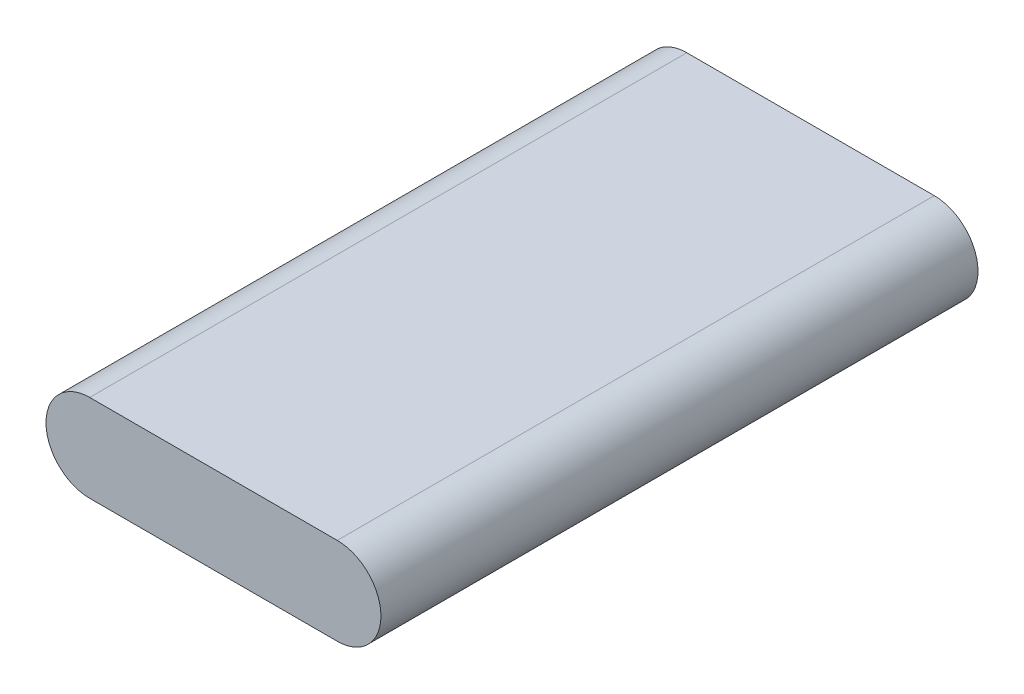
ISO-10303-21;
HEADER;
FILE_DESCRIPTION(('STEP AP214'),'2;1');
FILE_NAME('part.step','',(''),(''),'','','');
FILE_SCHEMA(('AUTOMOTIVE_DESIGN { 1 0 10303 214 1 1 1 1 }'));
ENDSEC;
DATA;
#1=APPLICATION_CONTEXT('core data for automotive mechanical design processes');
#2=APPLICATION_PROTOCOL_DEFINITION('international standard','automotive_design',2000,#1);
#3=PRODUCT_CONTEXT('',#1,'mechanical');
#4=PRODUCT('Part','Part','',(#3));
#5=PRODUCT_RELATED_PRODUCT_CATEGORY('part','',(#4));
#6=PRODUCT_DEFINITION_FORMATION('','',#4);
#7=PRODUCT_DEFINITION_CONTEXT('part definition',#1,'design');
#8=PRODUCT_DEFINITION('design','',#6,#7);
#9=PRODUCT_DEFINITION_SHAPE('','',#8);
#10=(LENGTH_UNIT() NAMED_UNIT(*) SI_UNIT(.MILLI.,.METRE.));
#11=(NAMED_UNIT(*) PLANE_ANGLE_UNIT() SI_UNIT($,.RADIAN.));
#12=(NAMED_UNIT(*) SI_UNIT($,.STERADIAN.) SOLID_ANGLE_UNIT());
#13=UNCERTAINTY_MEASURE_WITH_UNIT(LENGTH_MEASURE(1.E-05),#10,'distance_accuracy_value','');
#14=(GEOMETRIC_REPRESENTATION_CONTEXT(3) GLOBAL_UNCERTAINTY_ASSIGNED_CONTEXT((#13)) GLOBAL_UNIT_ASSIGNED_CONTEXT((#10,
#11,#12)) REPRESENTATION_CONTEXT('',''));
#15=CARTESIAN_POINT('',(0.,0.,0.));
#16=DIRECTION('',(0.,0.,1.));
#17=DIRECTION('',(1.,0.,0.));
#18=AXIS2_PLACEMENT_3D('',#15,#16,#17);
#19=CARTESIAN_POINT('',(0.,7.62,104.14));
#20=DIRECTION('',(0.,0.,-1.));
#21=DIRECTION('',(-1.,0.,0.));
#22=AXIS2_PLACEMENT_3D('',#19,#20,#21);
#23=CYLINDRICAL_SURFACE('',#22,7.62);
#24=CARTESIAN_POINT('',(0.,7.62,0.));
#25=DIRECTION('',(0.,0.,1.));
#26=DIRECTION('',(1.,0.,0.));
#27=AXIS2_PLACEMENT_3D('',#24,#25,#26);
#28=CIRCLE('',#27,7.62);
#29=CARTESIAN_POINT('',(0.,15.24,0.));
#30=VERTEX_POINT('',#29);
#31=CARTESIAN_POINT('',(0.,0.,0.));
#32=VERTEX_POINT('',#31);
#33=EDGE_CURVE('E95',#30,#32,#28,.T.);
#34=ORIENTED_EDGE('',*,*,#33,.T.);
#35=DIRECTION('',(0.,0.,-1.));
#36=VECTOR('',#35,1.);
#37=CARTESIAN_POINT('',(0.,0.,104.14));
#38=LINE('',#37,#36);
#39=CARTESIAN_POINT('',(0.,0.,104.14));
#40=VERTEX_POINT('',#39);
#41=EDGE_CURVE('E11',#40,#32,#38,.T.);
#42=ORIENTED_EDGE('',*,*,#41,.F.);
#43=CARTESIAN_POINT('',(0.,7.62,104.14));
#44=DIRECTION('',(0.,0.,1.));
#45=DIRECTION('',(1.,0.,0.));
#46=AXIS2_PLACEMENT_3D('',#43,#44,#45);
#47=CIRCLE('',#46,7.62);
#48=CARTESIAN_POINT('',(0.,15.24,104.14));
#49=VERTEX_POINT('',#48);
#50=EDGE_CURVE('E83',#49,#40,#47,.T.);
#51=ORIENTED_EDGE('',*,*,#50,.F.);
#52=DIRECTION('',(0.,0.,-1.));
#53=VECTOR('',#52,1.);
#54=CARTESIAN_POINT('',(0.,15.24,104.14));
#55=LINE('',#54,#53);
#56=EDGE_CURVE('E91',#49,#30,#55,.T.);
#57=ORIENTED_EDGE('',*,*,#56,.T.);
#58=EDGE_LOOP('',(#34,#42,#51,#57));
#59=FACE_BOUND('',#58,.T.);
#60=ADVANCED_FACE('F32',(#59),#23,.T.);
#61=CARTESIAN_POINT('',(0.,0.,104.14));
#62=DIRECTION('',(0.,1.,0.));
#63=DIRECTION('',(-1.,0.,0.));
#64=AXIS2_PLACEMENT_3D('',#61,#62,#63);
#65=PLANE('',#64);
#66=DIRECTION('',(1.,0.,0.));
#67=VECTOR('',#66,1.);
#68=CARTESIAN_POINT('',(0.,0.,0.));
#69=LINE('',#68,#67);
#70=CARTESIAN_POINT('',(43.18,0.,0.));
#71=VERTEX_POINT('',#70);
#72=EDGE_CURVE('E87',#32,#71,#69,.T.);
#73=ORIENTED_EDGE('',*,*,#72,.T.);
#74=DIRECTION('',(0.,0.,-1.));
#75=VECTOR('',#74,1.);
#76=CARTESIAN_POINT('',(43.18,0.,104.14));
#77=LINE('',#76,#75);
#78=CARTESIAN_POINT('',(43.18,0.,104.14));
#79=VERTEX_POINT('',#78);
#80=EDGE_CURVE('E40',#79,#71,#77,.T.);
#81=ORIENTED_EDGE('',*,*,#80,.F.);
#82=DIRECTION('',(1.,0.,0.));
#83=VECTOR('',#82,1.);
#84=CARTESIAN_POINT('',(0.,0.,104.14));
#85=LINE('',#84,#83);
#86=EDGE_CURVE('E78',#40,#79,#85,.T.);
#87=ORIENTED_EDGE('',*,*,#86,.F.);
#88=ORIENTED_EDGE('',*,*,#41,.T.);
#89=EDGE_LOOP('',(#73,#81,#87,#88));
#90=FACE_BOUND('',#89,.T.);
#91=ADVANCED_FACE('F86',(#90),#65,.F.);
#92=CARTESIAN_POINT('',(43.18,7.61999999999999,104.14));
#93=DIRECTION('',(0.,0.,-1.));
#94=DIRECTION('',(-1.,0.,0.));
#95=AXIS2_PLACEMENT_3D('',#92,#93,#94);
#96=CYLINDRICAL_SURFACE('',#95,7.62);
#97=CARTESIAN_POINT('',(43.18,7.61999999999999,0.));
#98=DIRECTION('',(0.,0.,1.));
#99=DIRECTION('',(-1.,0.,0.));
#100=AXIS2_PLACEMENT_3D('',#97,#98,#99);
#101=CIRCLE('',#100,7.62);
#102=CARTESIAN_POINT('',(43.18,15.24,0.));
#103=VERTEX_POINT('',#102);
#104=EDGE_CURVE('E65',#71,#103,#101,.T.);
#105=ORIENTED_EDGE('',*,*,#104,.T.);
#106=DIRECTION('',(0.,0.,-1.));
#107=VECTOR('',#106,1.);
#108=CARTESIAN_POINT('',(43.18,15.24,104.14));
#109=LINE('',#108,#107);
#110=CARTESIAN_POINT('',(43.18,15.24,104.14));
#111=VERTEX_POINT('',#110);
#112=EDGE_CURVE('E88',#111,#103,#109,.T.);
#113=ORIENTED_EDGE('',*,*,#112,.F.);
#114=CARTESIAN_POINT('',(43.18,7.61999999999999,104.14));
#115=DIRECTION('',(0.,0.,1.));
#116=DIRECTION('',(-1.,0.,0.));
#117=AXIS2_PLACEMENT_3D('',#114,#115,#116);
#118=CIRCLE('',#117,7.62);
#119=EDGE_CURVE('E81',#79,#111,#118,.T.);
#120=ORIENTED_EDGE('',*,*,#119,.F.);
#121=ORIENTED_EDGE('',*,*,#80,.T.);
#122=EDGE_LOOP('',(#105,#113,#120,#121));
#123=FACE_BOUND('',#122,.T.);
#124=ADVANCED_FACE('F89',(#123),#96,.T.);
#125=CARTESIAN_POINT('',(0.,15.24,104.14));
#126=DIRECTION('',(0.,-1.,0.));
#127=DIRECTION('',(1.,0.,0.));
#128=AXIS2_PLACEMENT_3D('',#125,#126,#127);
#129=PLANE('',#128);
#130=DIRECTION('',(-1.,0.,0.));
#131=VECTOR('',#130,1.);
#132=CARTESIAN_POINT('',(0.,15.24,0.));
#133=LINE('',#132,#131);
#134=EDGE_CURVE('E71',#103,#30,#133,.T.);
#135=ORIENTED_EDGE('',*,*,#134,.T.);
#136=ORIENTED_EDGE('',*,*,#56,.F.);
#137=DIRECTION('',(-1.,0.,0.));
#138=VECTOR('',#137,1.);
#139=CARTESIAN_POINT('',(0.,15.24,104.14));
#140=LINE('',#139,#138);
#141=EDGE_CURVE('E48',#111,#49,#140,.T.);
#142=ORIENTED_EDGE('',*,*,#141,.F.);
#143=ORIENTED_EDGE('',*,*,#112,.T.);
#144=EDGE_LOOP('',(#135,#136,#142,#143));
#145=FACE_BOUND('',#144,.T.);
#146=ADVANCED_FACE('F102',(#145),#129,.F.);
#147=CARTESIAN_POINT('',(0.,7.62,104.14));
#148=DIRECTION('',(0.,0.,1.));
#149=DIRECTION('',(1.,0.,0.));
#150=AXIS2_PLACEMENT_3D('',#147,#148,#149);
#151=PLANE('',#150);
#152=ORIENTED_EDGE('',*,*,#50,.T.);
#153=ORIENTED_EDGE('',*,*,#86,.T.);
#154=ORIENTED_EDGE('',*,*,#119,.T.);
#155=ORIENTED_EDGE('',*,*,#141,.T.);
#156=EDGE_LOOP('',(#152,#153,#154,#155));
#157=FACE_BOUND('',#156,.T.);
#158=ADVANCED_FACE('F79',(#157),#151,.T.);
#159=CARTESIAN_POINT('',(0.,7.62,0.));
#160=DIRECTION('',(0.,0.,1.));
#161=DIRECTION('',(1.,0.,0.));
#162=AXIS2_PLACEMENT_3D('',#159,#160,#161);
#163=PLANE('',#162);
#164=ORIENTED_EDGE('',*,*,#33,.F.);
#165=ORIENTED_EDGE('',*,*,#134,.F.);
#166=ORIENTED_EDGE('',*,*,#104,.F.);
#167=ORIENTED_EDGE('',*,*,#72,.F.);
#168=EDGE_LOOP('',(#164,#165,#166,#167));
#169=FACE_BOUND('',#168,.T.);
#170=ADVANCED_FACE('F105',(#169),#163,.F.);
#171=CLOSED_SHELL('',(#60,#91,#124,#146,#158,#170));
#172=MANIFOLD_SOLID_BREP('B2',#171);
#173=ADVANCED_BREP_SHAPE_REPRESENTATION('',(#18,#172),#14);
#174=SHAPE_DEFINITION_REPRESENTATION(#9,#173);
ENDSEC;
END-ISO-10303-21;
